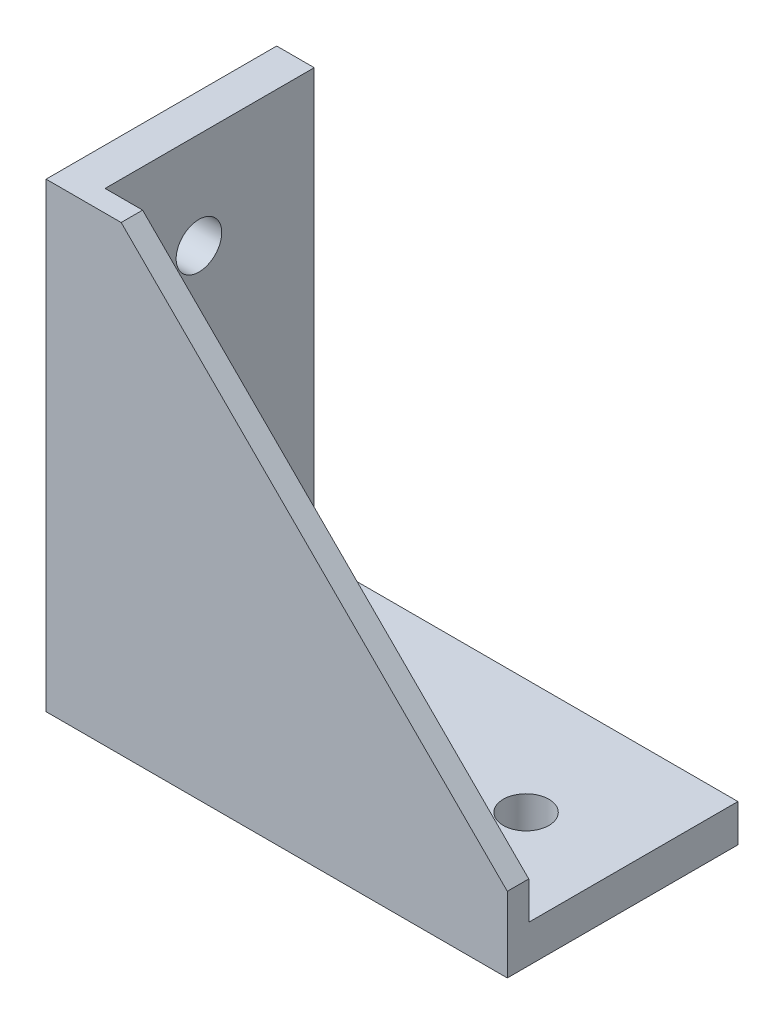
ISO-10303-21;
HEADER;
FILE_DESCRIPTION(('STEP AP214'),'2;1');
FILE_NAME('part.step','',(''),(''),'','','');
FILE_SCHEMA(('AUTOMOTIVE_DESIGN { 1 0 10303 214 1 1 1 1 }'));
ENDSEC;
DATA;
#1=APPLICATION_CONTEXT('core data for automotive mechanical design processes');
#2=APPLICATION_PROTOCOL_DEFINITION('international standard','automotive_design',2000,#1);
#3=PRODUCT_CONTEXT('',#1,'mechanical');
#4=PRODUCT('Part','Part','',(#3));
#5=PRODUCT_RELATED_PRODUCT_CATEGORY('part','',(#4));
#6=PRODUCT_DEFINITION_FORMATION('','',#4);
#7=PRODUCT_DEFINITION_CONTEXT('part definition',#1,'design');
#8=PRODUCT_DEFINITION('design','',#6,#7);
#9=PRODUCT_DEFINITION_SHAPE('','',#8);
#10=(LENGTH_UNIT() NAMED_UNIT(*) SI_UNIT(.MILLI.,.METRE.));
#11=(NAMED_UNIT(*) PLANE_ANGLE_UNIT() SI_UNIT($,.RADIAN.));
#12=(NAMED_UNIT(*) SI_UNIT($,.STERADIAN.) SOLID_ANGLE_UNIT());
#13=UNCERTAINTY_MEASURE_WITH_UNIT(LENGTH_MEASURE(1.E-05),#10,'distance_accuracy_value','');
#14=(GEOMETRIC_REPRESENTATION_CONTEXT(3) GLOBAL_UNCERTAINTY_ASSIGNED_CONTEXT((#13)) GLOBAL_UNIT_ASSIGNED_CONTEXT((#10,
#11,#12)) REPRESENTATION_CONTEXT('',''));
#15=CARTESIAN_POINT('',(0.,0.,0.));
#16=DIRECTION('',(0.,0.,1.));
#17=DIRECTION('',(1.,0.,0.));
#18=AXIS2_PLACEMENT_3D('',#15,#16,#17);
#19=CARTESIAN_POINT('',(0.,0.,21.5));
#20=DIRECTION('',(0.,1.,0.));
#21=DIRECTION('',(0.,0.,1.));
#22=AXIS2_PLACEMENT_3D('',#19,#20,#21);
#23=PLANE('',#22);
#24=DIRECTION('',(0.,0.,1.));
#25=VECTOR('',#24,1.);
#26=CARTESIAN_POINT('',(6.,0.,-5.));
#27=LINE('',#26,#25);
#28=CARTESIAN_POINT('',(6.,0.,-5.));
#29=VERTEX_POINT('',#28);
#30=CARTESIAN_POINT('',(6.,0.,5.));
#31=VERTEX_POINT('',#30);
#32=EDGE_CURVE('E383',#29,#31,#27,.T.);
#33=ORIENTED_EDGE('',*,*,#32,.F.);
#34=DIRECTION('',(1.,0.,0.));
#35=VECTOR('',#34,1.);
#36=CARTESIAN_POINT('',(3.,0.,-5.));
#37=LINE('',#36,#35);
#38=CARTESIAN_POINT('',(3.,0.,-5.));
#39=VERTEX_POINT('',#38);
#40=EDGE_CURVE('E388',#39,#29,#37,.T.);
#41=ORIENTED_EDGE('',*,*,#40,.F.);
#42=DIRECTION('',(0.,0.,-1.));
#43=VECTOR('',#42,1.);
#44=CARTESIAN_POINT('',(3.,0.,-5.));
#45=LINE('',#44,#43);
#46=CARTESIAN_POINT('',(3.,0.,5.));
#47=VERTEX_POINT('',#46);
#48=EDGE_CURVE('E400',#47,#39,#45,.T.);
#49=ORIENTED_EDGE('',*,*,#48,.F.);
#50=DIRECTION('',(-1.,0.,0.));
#51=VECTOR('',#50,1.);
#52=CARTESIAN_POINT('',(3.,0.,5.));
#53=LINE('',#52,#51);
#54=EDGE_CURVE('E397',#31,#47,#53,.T.);
#55=ORIENTED_EDGE('',*,*,#54,.F.);
#56=EDGE_LOOP('',(#33,#41,#49,#55));
#57=FACE_BOUND('',#56,.T.);
#58=DIRECTION('',(-1.,0.,0.));
#59=VECTOR('',#58,1.);
#60=CARTESIAN_POINT('',(20.,0.,-4.25));
#61=LINE('',#60,#59);
#62=CARTESIAN_POINT('',(46.,0.,-4.25));
#63=VERTEX_POINT('',#62);
#64=CARTESIAN_POINT('',(20.,0.,-4.25));
#65=VERTEX_POINT('',#64);
#66=EDGE_CURVE('E427',#63,#65,#61,.T.);
#67=ORIENTED_EDGE('',*,*,#66,.T.);
#68=CARTESIAN_POINT('',(20.,0.,0.));
#69=DIRECTION('',(0.,1.,0.));
#70=DIRECTION('',(0.,0.,1.));
#71=AXIS2_PLACEMENT_3D('',#68,#69,#70);
#72=CIRCLE('',#71,4.25);
#73=CARTESIAN_POINT('',(20.,0.,4.25));
#74=VERTEX_POINT('',#73);
#75=EDGE_CURVE('E417',#65,#74,#72,.T.);
#76=ORIENTED_EDGE('',*,*,#75,.T.);
#77=DIRECTION('',(1.,0.,0.));
#78=VECTOR('',#77,1.);
#79=CARTESIAN_POINT('',(20.,0.,4.25));
#80=LINE('',#79,#78);
#81=CARTESIAN_POINT('',(46.,0.,4.25));
#82=VERTEX_POINT('',#81);
#83=EDGE_CURVE('E420',#74,#82,#80,.T.);
#84=ORIENTED_EDGE('',*,*,#83,.T.);
#85=CARTESIAN_POINT('',(46.,0.,0.));
#86=DIRECTION('',(0.,1.,0.));
#87=DIRECTION('',(0.,0.,1.));
#88=AXIS2_PLACEMENT_3D('',#85,#86,#87);
#89=CIRCLE('',#88,4.25);
#90=EDGE_CURVE('E424',#82,#63,#89,.T.);
#91=ORIENTED_EDGE('',*,*,#90,.T.);
#92=EDGE_LOOP('',(#67,#76,#84,#91));
#93=FACE_BOUND('',#92,.T.);
#94=CARTESIAN_POINT('',(68.,0.,0.));
#95=DIRECTION('',(0.,1.,0.));
#96=DIRECTION('',(0.,0.,1.));
#97=AXIS2_PLACEMENT_3D('',#94,#95,#96);
#98=CIRCLE('',#97,4.25000000000001);
#99=CARTESIAN_POINT('',(68.,0.,4.25000000000001));
#100=VERTEX_POINT('',#99);
#101=EDGE_CURVE('E434',#100,#100,#98,.T.);
#102=ORIENTED_EDGE('',*,*,#101,.T.);
#103=EDGE_LOOP('',(#102));
#104=FACE_BOUND('',#103,.T.);
#105=DIRECTION('',(1.,0.,0.));
#106=VECTOR('',#105,1.);
#107=CARTESIAN_POINT('',(0.,0.,-21.5));
#108=LINE('',#107,#106);
#109=CARTESIAN_POINT('',(0.,0.,-21.5));
#110=VERTEX_POINT('',#109);
#111=CARTESIAN_POINT('',(86.,0.,-21.5));
#112=VERTEX_POINT('',#111);
#113=EDGE_CURVE('E494',#110,#112,#108,.T.);
#114=ORIENTED_EDGE('',*,*,#113,.T.);
#115=DIRECTION('',(0.,0.,-1.));
#116=VECTOR('',#115,1.);
#117=CARTESIAN_POINT('',(86.,0.,21.5));
#118=LINE('',#117,#116);
#119=CARTESIAN_POINT('',(86.,0.,21.5));
#120=VERTEX_POINT('',#119);
#121=EDGE_CURVE('E509',#120,#112,#118,.T.);
#122=ORIENTED_EDGE('',*,*,#121,.F.);
#123=DIRECTION('',(1.,0.,0.));
#124=VECTOR('',#123,1.);
#125=CARTESIAN_POINT('',(0.,0.,21.5));
#126=LINE('',#125,#124);
#127=CARTESIAN_POINT('',(0.,0.,21.5));
#128=VERTEX_POINT('',#127);
#129=EDGE_CURVE('E485',#128,#120,#126,.T.);
#130=ORIENTED_EDGE('',*,*,#129,.F.);
#131=DIRECTION('',(0.,0.,-1.));
#132=VECTOR('',#131,1.);
#133=CARTESIAN_POINT('',(0.,0.,21.5));
#134=LINE('',#133,#132);
#135=EDGE_CURVE('E42',#128,#110,#134,.T.);
#136=ORIENTED_EDGE('',*,*,#135,.T.);
#137=EDGE_LOOP('',(#114,#122,#130,#136));
#138=FACE_BOUND('',#137,.T.);
#139=DIRECTION('',(0.,0.,1.));
#140=VECTOR('',#139,1.);
#141=CARTESIAN_POINT('',(83.,0.,-4.99999999999999));
#142=LINE('',#141,#140);
#143=CARTESIAN_POINT('',(83.,0.,-4.99999999999999));
#144=VERTEX_POINT('',#143);
#145=CARTESIAN_POINT('',(83.,0.,5.00000000000001));
#146=VERTEX_POINT('',#145);
#147=EDGE_CURVE('E340',#144,#146,#142,.T.);
#148=ORIENTED_EDGE('',*,*,#147,.F.);
#149=DIRECTION('',(1.,0.,0.));
#150=VECTOR('',#149,1.);
#151=CARTESIAN_POINT('',(80.,0.,-4.99999999999999));
#152=LINE('',#151,#150);
#153=CARTESIAN_POINT('',(80.,0.,-4.99999999999999));
#154=VERTEX_POINT('',#153);
#155=EDGE_CURVE('E355',#154,#144,#152,.T.);
#156=ORIENTED_EDGE('',*,*,#155,.F.);
#157=DIRECTION('',(0.,0.,-1.));
#158=VECTOR('',#157,1.);
#159=CARTESIAN_POINT('',(80.,0.,-4.99999999999999));
#160=LINE('',#159,#158);
#161=CARTESIAN_POINT('',(80.,0.,5.00000000000001));
#162=VERTEX_POINT('',#161);
#163=EDGE_CURVE('E367',#162,#154,#160,.T.);
#164=ORIENTED_EDGE('',*,*,#163,.F.);
#165=DIRECTION('',(-1.,0.,0.));
#166=VECTOR('',#165,1.);
#167=CARTESIAN_POINT('',(80.,0.,5.00000000000001));
#168=LINE('',#167,#166);
#169=EDGE_CURVE('E364',#146,#162,#168,.T.);
#170=ORIENTED_EDGE('',*,*,#169,.F.);
#171=EDGE_LOOP('',(#148,#156,#164,#170));
#172=FACE_BOUND('',#171,.T.);
#173=ADVANCED_FACE('F34',(#57,#93,#104,#138,#172),#23,.F.);
#174=CARTESIAN_POINT('',(7.,86.,21.5));
#175=DIRECTION('',(0.,-1.,0.));
#176=DIRECTION('',(0.,0.,-1.));
#177=AXIS2_PLACEMENT_3D('',#174,#175,#176);
#178=PLANE('',#177);
#179=DIRECTION('',(-1.,0.,0.));
#180=VECTOR('',#179,1.);
#181=CARTESIAN_POINT('',(7.,86.,-21.5));
#182=LINE('',#181,#180);
#183=CARTESIAN_POINT('',(7.,86.,-21.5));
#184=VERTEX_POINT('',#183);
#185=CARTESIAN_POINT('',(0.,86.,-21.5));
#186=VERTEX_POINT('',#185);
#187=EDGE_CURVE('E476',#184,#186,#182,.T.);
#188=ORIENTED_EDGE('',*,*,#187,.T.);
#189=DIRECTION('',(0.,0.,-1.));
#190=VECTOR('',#189,1.);
#191=CARTESIAN_POINT('',(0.,86.,21.5));
#192=LINE('',#191,#190);
#193=CARTESIAN_POINT('',(0.,86.,21.5));
#194=VERTEX_POINT('',#193);
#195=EDGE_CURVE('E11',#194,#186,#192,.T.);
#196=ORIENTED_EDGE('',*,*,#195,.F.);
#197=DIRECTION('',(-1.,0.,0.));
#198=VECTOR('',#197,1.);
#199=CARTESIAN_POINT('',(7.,86.,21.5));
#200=LINE('',#199,#198);
#201=CARTESIAN_POINT('',(14.,86.,21.5));
#202=VERTEX_POINT('',#201);
#203=EDGE_CURVE('E479',#202,#194,#200,.T.);
#204=ORIENTED_EDGE('',*,*,#203,.F.);
#205=DIRECTION('',(0.,0.,1.));
#206=VECTOR('',#205,1.);
#207=CARTESIAN_POINT('',(14.,86.,17.5));
#208=LINE('',#207,#206);
#209=CARTESIAN_POINT('',(14.,86.,17.5));
#210=VERTEX_POINT('',#209);
#211=EDGE_CURVE('E473',#210,#202,#208,.T.);
#212=ORIENTED_EDGE('',*,*,#211,.F.);
#213=DIRECTION('',(-1.,0.,0.));
#214=VECTOR('',#213,1.);
#215=CARTESIAN_POINT('',(7.,86.,17.5));
#216=LINE('',#215,#214);
#217=CARTESIAN_POINT('',(7.,86.,17.5));
#218=VERTEX_POINT('',#217);
#219=EDGE_CURVE('E455',#210,#218,#216,.T.);
#220=ORIENTED_EDGE('',*,*,#219,.T.);
#221=DIRECTION('',(0.,0.,-1.));
#222=VECTOR('',#221,1.);
#223=CARTESIAN_POINT('',(7.,86.,21.5));
#224=LINE('',#223,#222);
#225=EDGE_CURVE('E489',#218,#184,#224,.T.);
#226=ORIENTED_EDGE('',*,*,#225,.T.);
#227=EDGE_LOOP('',(#188,#196,#204,#212,#220,#226));
#228=FACE_BOUND('',#227,.T.);
#229=ADVANCED_FACE('F36',(#228),#178,.F.);
#230=CARTESIAN_POINT('',(0.,86.,21.5));
#231=DIRECTION('',(1.,0.,0.));
#232=DIRECTION('',(0.,1.,0.));
#233=AXIS2_PLACEMENT_3D('',#230,#231,#232);
#234=PLANE('',#233);
#235=DIRECTION('',(0.,1.,0.));
#236=VECTOR('',#235,1.);
#237=CARTESIAN_POINT('',(0.,80.,-4.99999999999999));
#238=LINE('',#237,#236);
#239=CARTESIAN_POINT('',(0.,80.,-4.99999999999999));
#240=VERTEX_POINT('',#239);
#241=CARTESIAN_POINT('',(0.,83.,-4.99999999999999));
#242=VERTEX_POINT('',#241);
#243=EDGE_CURVE('E275',#240,#242,#238,.T.);
#244=ORIENTED_EDGE('',*,*,#243,.T.);
#245=DIRECTION('',(0.,0.,1.));
#246=VECTOR('',#245,1.);
#247=CARTESIAN_POINT('',(0.,83.,-4.99999999999999));
#248=LINE('',#247,#246);
#249=CARTESIAN_POINT('',(0.,83.,5.00000000000001));
#250=VERTEX_POINT('',#249);
#251=EDGE_CURVE('E249',#242,#250,#248,.T.);
#252=ORIENTED_EDGE('',*,*,#251,.T.);
#253=DIRECTION('',(0.,-1.,0.));
#254=VECTOR('',#253,1.);
#255=CARTESIAN_POINT('',(0.,80.,5.00000000000001));
#256=LINE('',#255,#254);
#257=CARTESIAN_POINT('',(0.,80.,5.00000000000001));
#258=VERTEX_POINT('',#257);
#259=EDGE_CURVE('E265',#250,#258,#256,.T.);
#260=ORIENTED_EDGE('',*,*,#259,.T.);
#261=DIRECTION('',(0.,0.,-1.));
#262=VECTOR('',#261,1.);
#263=CARTESIAN_POINT('',(0.,80.,-4.99999999999999));
#264=LINE('',#263,#262);
#265=EDGE_CURVE('E49',#258,#240,#264,.T.);
#266=ORIENTED_EDGE('',*,*,#265,.T.);
#267=EDGE_LOOP('',(#244,#252,#260,#266));
#268=FACE_BOUND('',#267,.T.);
#269=DIRECTION('',(0.,1.,0.));
#270=VECTOR('',#269,1.);
#271=CARTESIAN_POINT('',(0.,3.,-5.));
#272=LINE('',#271,#270);
#273=CARTESIAN_POINT('',(0.,3.,-5.));
#274=VERTEX_POINT('',#273);
#275=CARTESIAN_POINT('',(0.,6.,-5.));
#276=VERTEX_POINT('',#275);
#277=EDGE_CURVE('E300',#274,#276,#272,.T.);
#278=ORIENTED_EDGE('',*,*,#277,.T.);
#279=DIRECTION('',(0.,0.,1.));
#280=VECTOR('',#279,1.);
#281=CARTESIAN_POINT('',(0.,6.,-5.));
#282=LINE('',#281,#280);
#283=CARTESIAN_POINT('',(0.,6.,5.));
#284=VERTEX_POINT('',#283);
#285=EDGE_CURVE('E254',#276,#284,#282,.T.);
#286=ORIENTED_EDGE('',*,*,#285,.T.);
#287=DIRECTION('',(0.,-1.,0.));
#288=VECTOR('',#287,1.);
#289=CARTESIAN_POINT('',(0.,3.,5.));
#290=LINE('',#289,#288);
#291=CARTESIAN_POINT('',(0.,3.,5.));
#292=VERTEX_POINT('',#291);
#293=EDGE_CURVE('E288',#284,#292,#290,.T.);
#294=ORIENTED_EDGE('',*,*,#293,.T.);
#295=DIRECTION('',(0.,0.,-1.));
#296=VECTOR('',#295,1.);
#297=CARTESIAN_POINT('',(0.,3.,-5.));
#298=LINE('',#297,#296);
#299=EDGE_CURVE('E57',#292,#274,#298,.T.);
#300=ORIENTED_EDGE('',*,*,#299,.T.);
#301=EDGE_LOOP('',(#278,#286,#294,#300));
#302=FACE_BOUND('',#301,.T.);
#303=CARTESIAN_POINT('',(0.,20.,0.));
#304=DIRECTION('',(-1.,0.,0.));
#305=DIRECTION('',(0.,0.,1.));
#306=AXIS2_PLACEMENT_3D('',#303,#304,#305);
#307=CIRCLE('',#306,4.25);
#308=CARTESIAN_POINT('',(0.,20.,-4.25));
#309=VERTEX_POINT('',#308);
#310=CARTESIAN_POINT('',(0.,20.,4.25));
#311=VERTEX_POINT('',#310);
#312=EDGE_CURVE('E314',#309,#311,#307,.T.);
#313=ORIENTED_EDGE('',*,*,#312,.F.);
#314=DIRECTION('',(0.,-1.,0.));
#315=VECTOR('',#314,1.);
#316=CARTESIAN_POINT('',(0.,20.,-4.25));
#317=LINE('',#316,#315);
#318=CARTESIAN_POINT('',(0.,46.,-4.25));
#319=VERTEX_POINT('',#318);
#320=EDGE_CURVE('E316',#319,#309,#317,.T.);
#321=ORIENTED_EDGE('',*,*,#320,.F.);
#322=CARTESIAN_POINT('',(0.,46.,0.));
#323=DIRECTION('',(-1.,0.,0.));
#324=DIRECTION('',(0.,0.,1.));
#325=AXIS2_PLACEMENT_3D('',#322,#323,#324);
#326=CIRCLE('',#325,4.25);
#327=CARTESIAN_POINT('',(0.,46.,4.25));
#328=VERTEX_POINT('',#327);
#329=EDGE_CURVE('E319',#328,#319,#326,.T.);
#330=ORIENTED_EDGE('',*,*,#329,.F.);
#331=DIRECTION('',(0.,1.,0.));
#332=VECTOR('',#331,1.);
#333=CARTESIAN_POINT('',(0.,20.,4.25));
#334=LINE('',#333,#332);
#335=EDGE_CURVE('E322',#311,#328,#334,.T.);
#336=ORIENTED_EDGE('',*,*,#335,.F.);
#337=EDGE_LOOP('',(#313,#321,#330,#336));
#338=FACE_BOUND('',#337,.T.);
#339=CARTESIAN_POINT('',(0.,68.,0.));
#340=DIRECTION('',(-1.,0.,0.));
#341=DIRECTION('',(0.,0.,1.));
#342=AXIS2_PLACEMENT_3D('',#339,#340,#341);
#343=CIRCLE('',#342,4.25000000000001);
#344=CARTESIAN_POINT('',(0.,68.,4.25000000000001));
#345=VERTEX_POINT('',#344);
#346=EDGE_CURVE('E329',#345,#345,#343,.T.);
#347=ORIENTED_EDGE('',*,*,#346,.F.);
#348=EDGE_LOOP('',(#347));
#349=FACE_BOUND('',#348,.T.);
#350=DIRECTION('',(0.,-1.,0.));
#351=VECTOR('',#350,1.);
#352=CARTESIAN_POINT('',(0.,86.,-21.5));
#353=LINE('',#352,#351);
#354=EDGE_CURVE('E492',#186,#110,#353,.T.);
#355=ORIENTED_EDGE('',*,*,#354,.T.);
#356=ORIENTED_EDGE('',*,*,#135,.F.);
#357=DIRECTION('',(0.,-1.,0.));
#358=VECTOR('',#357,1.);
#359=CARTESIAN_POINT('',(0.,86.,21.5));
#360=LINE('',#359,#358);
#361=EDGE_CURVE('E482',#194,#128,#360,.T.);
#362=ORIENTED_EDGE('',*,*,#361,.F.);
#363=ORIENTED_EDGE('',*,*,#195,.T.);
#364=EDGE_LOOP('',(#355,#356,#362,#363));
#365=FACE_BOUND('',#364,.T.);
#366=ADVANCED_FACE('F533',(#268,#302,#338,#349,#365),#234,.F.);
#367=CARTESIAN_POINT('',(86.,0.,21.5));
#368=DIRECTION('',(-1.,0.,0.));
#369=DIRECTION('',(0.,0.,1.));
#370=AXIS2_PLACEMENT_3D('',#367,#368,#369);
#371=PLANE('',#370);
#372=DIRECTION('',(0.,1.,0.));
#373=VECTOR('',#372,1.);
#374=CARTESIAN_POINT('',(86.,0.,-21.5));
#375=LINE('',#374,#373);
#376=CARTESIAN_POINT('',(86.,7.,-21.5));
#377=VERTEX_POINT('',#376);
#378=EDGE_CURVE('E496',#112,#377,#375,.T.);
#379=ORIENTED_EDGE('',*,*,#378,.T.);
#380=DIRECTION('',(0.,0.,-1.));
#381=VECTOR('',#380,1.);
#382=CARTESIAN_POINT('',(86.,7.,21.5));
#383=LINE('',#382,#381);
#384=CARTESIAN_POINT('',(86.,7.,17.5));
#385=VERTEX_POINT('',#384);
#386=EDGE_CURVE('E507',#385,#377,#383,.T.);
#387=ORIENTED_EDGE('',*,*,#386,.F.);
#388=DIRECTION('',(0.,1.,0.));
#389=VECTOR('',#388,1.);
#390=CARTESIAN_POINT('',(86.,14.,17.5));
#391=LINE('',#390,#389);
#392=CARTESIAN_POINT('',(86.,14.,17.5));
#393=VERTEX_POINT('',#392);
#394=EDGE_CURVE('E464',#385,#393,#391,.T.);
#395=ORIENTED_EDGE('',*,*,#394,.T.);
#396=DIRECTION('',(0.,0.,1.));
#397=VECTOR('',#396,1.);
#398=CARTESIAN_POINT('',(86.,14.,17.5));
#399=LINE('',#398,#397);
#400=CARTESIAN_POINT('',(86.,14.,21.5));
#401=VERTEX_POINT('',#400);
#402=EDGE_CURVE('E470',#393,#401,#399,.T.);
#403=ORIENTED_EDGE('',*,*,#402,.T.);
#404=DIRECTION('',(0.,1.,0.));
#405=VECTOR('',#404,1.);
#406=CARTESIAN_POINT('',(86.,0.,21.5));
#407=LINE('',#406,#405);
#408=EDGE_CURVE('E487',#120,#401,#407,.T.);
#409=ORIENTED_EDGE('',*,*,#408,.F.);
#410=ORIENTED_EDGE('',*,*,#121,.T.);
#411=EDGE_LOOP('',(#379,#387,#395,#403,#409,#410));
#412=FACE_BOUND('',#411,.T.);
#413=ADVANCED_FACE('F527',(#412),#371,.F.);
#414=CARTESIAN_POINT('',(7.00000000000001,7.,21.5));
#415=DIRECTION('',(0.,-1.,0.));
#416=DIRECTION('',(0.,0.,-1.));
#417=AXIS2_PLACEMENT_3D('',#414,#415,#416);
#418=PLANE('',#417);
#419=DIRECTION('',(1.,0.,0.));
#420=VECTOR('',#419,1.);
#421=CARTESIAN_POINT('',(20.,7.,4.25));
#422=LINE('',#421,#420);
#423=CARTESIAN_POINT('',(20.,7.,4.25));
#424=VERTEX_POINT('',#423);
#425=CARTESIAN_POINT('',(46.,7.,4.25));
#426=VERTEX_POINT('',#425);
#427=EDGE_CURVE('E433',#424,#426,#422,.T.);
#428=ORIENTED_EDGE('',*,*,#427,.F.);
#429=CARTESIAN_POINT('',(20.,7.,0.));
#430=DIRECTION('',(0.,1.,0.));
#431=DIRECTION('',(0.,0.,1.));
#432=AXIS2_PLACEMENT_3D('',#429,#430,#431);
#433=CIRCLE('',#432,4.25);
#434=CARTESIAN_POINT('',(20.,7.,-4.25));
#435=VERTEX_POINT('',#434);
#436=EDGE_CURVE('E431',#435,#424,#433,.T.);
#437=ORIENTED_EDGE('',*,*,#436,.F.);
#438=DIRECTION('',(-1.,0.,0.));
#439=VECTOR('',#438,1.);
#440=CARTESIAN_POINT('',(20.,7.,-4.25));
#441=LINE('',#440,#439);
#442=CARTESIAN_POINT('',(46.,7.,-4.25));
#443=VERTEX_POINT('',#442);
#444=EDGE_CURVE('E421',#443,#435,#441,.T.);
#445=ORIENTED_EDGE('',*,*,#444,.F.);
#446=CARTESIAN_POINT('',(46.,7.,0.));
#447=DIRECTION('',(0.,1.,0.));
#448=DIRECTION('',(0.,0.,1.));
#449=AXIS2_PLACEMENT_3D('',#446,#447,#448);
#450=CIRCLE('',#449,4.25);
#451=EDGE_CURVE('E437',#426,#443,#450,.T.);
#452=ORIENTED_EDGE('',*,*,#451,.F.);
#453=EDGE_LOOP('',(#428,#437,#445,#452));
#454=FACE_BOUND('',#453,.T.);
#455=CARTESIAN_POINT('',(68.,7.,0.));
#456=DIRECTION('',(0.,1.,0.));
#457=DIRECTION('',(0.,0.,1.));
#458=AXIS2_PLACEMENT_3D('',#455,#456,#457);
#459=CIRCLE('',#458,4.25000000000001);
#460=CARTESIAN_POINT('',(68.,7.,4.25000000000001));
#461=VERTEX_POINT('',#460);
#462=EDGE_CURVE('E416',#461,#461,#459,.T.);
#463=ORIENTED_EDGE('',*,*,#462,.F.);
#464=EDGE_LOOP('',(#463));
#465=FACE_BOUND('',#464,.T.);
#466=DIRECTION('',(0.,0.,-1.));
#467=VECTOR('',#466,1.);
#468=CARTESIAN_POINT('',(7.00000000000001,7.,21.5));
#469=LINE('',#468,#467);
#470=CARTESIAN_POINT('',(7.00000000000001,7.,17.5));
#471=VERTEX_POINT('',#470);
#472=CARTESIAN_POINT('',(7.00000000000001,7.,-21.5));
#473=VERTEX_POINT('',#472);
#474=EDGE_CURVE('E505',#471,#473,#469,.T.);
#475=ORIENTED_EDGE('',*,*,#474,.F.);
#476=DIRECTION('',(1.,0.,0.));
#477=VECTOR('',#476,1.);
#478=CARTESIAN_POINT('',(86.,7.,17.5));
#479=LINE('',#478,#477);
#480=EDGE_CURVE('E461',#471,#385,#479,.T.);
#481=ORIENTED_EDGE('',*,*,#480,.T.);
#482=ORIENTED_EDGE('',*,*,#386,.T.);
#483=DIRECTION('',(-1.,0.,0.));
#484=VECTOR('',#483,1.);
#485=CARTESIAN_POINT('',(7.00000000000001,7.,-21.5));
#486=LINE('',#485,#484);
#487=EDGE_CURVE('E499',#377,#473,#486,.T.);
#488=ORIENTED_EDGE('',*,*,#487,.T.);
#489=EDGE_LOOP('',(#475,#481,#482,#488));
#490=FACE_BOUND('',#489,.T.);
#491=ADVANCED_FACE('F540',(#454,#465,#490),#418,.F.);
#492=CARTESIAN_POINT('',(7.,86.,21.5));
#493=DIRECTION('',(-1.,0.,0.));
#494=DIRECTION('',(0.,-1.,0.));
#495=AXIS2_PLACEMENT_3D('',#492,#493,#494);
#496=PLANE('',#495);
#497=CARTESIAN_POINT('',(7.,20.,0.));
#498=DIRECTION('',(-1.,0.,0.));
#499=DIRECTION('',(0.,0.,1.));
#500=AXIS2_PLACEMENT_3D('',#497,#498,#499);
#501=CIRCLE('',#500,4.25);
#502=CARTESIAN_POINT('',(7.00000000000001,20.,-4.25));
#503=VERTEX_POINT('',#502);
#504=CARTESIAN_POINT('',(7.,20.,4.25));
#505=VERTEX_POINT('',#504);
#506=EDGE_CURVE('E325',#503,#505,#501,.T.);
#507=ORIENTED_EDGE('',*,*,#506,.T.);
#508=DIRECTION('',(0.,1.,0.));
#509=VECTOR('',#508,1.);
#510=CARTESIAN_POINT('',(7.,20.,4.25));
#511=LINE('',#510,#509);
#512=CARTESIAN_POINT('',(7.00000000000001,46.,4.25));
#513=VERTEX_POINT('',#512);
#514=EDGE_CURVE('E317',#505,#513,#511,.T.);
#515=ORIENTED_EDGE('',*,*,#514,.T.);
#516=CARTESIAN_POINT('',(7.00000000000001,46.,0.));
#517=DIRECTION('',(-1.,0.,0.));
#518=DIRECTION('',(0.,0.,1.));
#519=AXIS2_PLACEMENT_3D('',#516,#517,#518);
#520=CIRCLE('',#519,4.25);
#521=CARTESIAN_POINT('',(7.00000000000001,46.,-4.25));
#522=VERTEX_POINT('',#521);
#523=EDGE_CURVE('E332',#513,#522,#520,.T.);
#524=ORIENTED_EDGE('',*,*,#523,.T.);
#525=DIRECTION('',(0.,-1.,0.));
#526=VECTOR('',#525,1.);
#527=CARTESIAN_POINT('',(7.,20.,-4.25));
#528=LINE('',#527,#526);
#529=EDGE_CURVE('E328',#522,#503,#528,.T.);
#530=ORIENTED_EDGE('',*,*,#529,.T.);
#531=EDGE_LOOP('',(#507,#515,#524,#530));
#532=FACE_BOUND('',#531,.T.);
#533=CARTESIAN_POINT('',(7.00000000000002,68.,0.));
#534=DIRECTION('',(-1.,0.,0.));
#535=DIRECTION('',(0.,0.,1.));
#536=AXIS2_PLACEMENT_3D('',#533,#534,#535);
#537=CIRCLE('',#536,4.25000000000001);
#538=CARTESIAN_POINT('',(7.00000000000002,68.,4.25000000000001));
#539=VERTEX_POINT('',#538);
#540=EDGE_CURVE('E313',#539,#539,#537,.T.);
#541=ORIENTED_EDGE('',*,*,#540,.T.);
#542=EDGE_LOOP('',(#541));
#543=FACE_BOUND('',#542,.T.);
#544=ORIENTED_EDGE('',*,*,#225,.F.);
#545=DIRECTION('',(0.,-1.,0.));
#546=VECTOR('',#545,1.);
#547=CARTESIAN_POINT('',(7.00000000000001,7.,17.5));
#548=LINE('',#547,#546);
#549=EDGE_CURVE('E458',#218,#471,#548,.T.);
#550=ORIENTED_EDGE('',*,*,#549,.T.);
#551=ORIENTED_EDGE('',*,*,#474,.T.);
#552=DIRECTION('',(0.,1.,0.));
#553=VECTOR('',#552,1.);
#554=CARTESIAN_POINT('',(7.,86.,-21.5));
#555=LINE('',#554,#553);
#556=EDGE_CURVE('E483',#473,#184,#555,.T.);
#557=ORIENTED_EDGE('',*,*,#556,.T.);
#558=EDGE_LOOP('',(#544,#550,#551,#557));
#559=FACE_BOUND('',#558,.T.);
#560=ADVANCED_FACE('F537',(#532,#543,#559),#496,.F.);
#561=CARTESIAN_POINT('',(0.,0.,21.5));
#562=DIRECTION('',(0.,0.,1.));
#563=DIRECTION('',(1.,0.,0.));
#564=AXIS2_PLACEMENT_3D('',#561,#562,#563);
#565=PLANE('',#564);
#566=ORIENTED_EDGE('',*,*,#203,.T.);
#567=ORIENTED_EDGE('',*,*,#361,.T.);
#568=ORIENTED_EDGE('',*,*,#129,.T.);
#569=ORIENTED_EDGE('',*,*,#408,.T.);
#570=DIRECTION('',(-0.707106781186547,0.707106781186547,0.));
#571=VECTOR('',#570,1.);
#572=CARTESIAN_POINT('',(14.,86.,21.5));
#573=LINE('',#572,#571);
#574=EDGE_CURVE('E444',#401,#202,#573,.T.);
#575=ORIENTED_EDGE('',*,*,#574,.T.);
#576=EDGE_LOOP('',(#566,#567,#568,#569,#575));
#577=FACE_BOUND('',#576,.T.);
#578=ADVANCED_FACE('F531',(#577),#565,.T.);
#579=CARTESIAN_POINT('',(0.,0.,-21.5));
#580=DIRECTION('',(0.,0.,1.));
#581=DIRECTION('',(1.,0.,0.));
#582=AXIS2_PLACEMENT_3D('',#579,#580,#581);
#583=PLANE('',#582);
#584=ORIENTED_EDGE('',*,*,#187,.F.);
#585=ORIENTED_EDGE('',*,*,#556,.F.);
#586=ORIENTED_EDGE('',*,*,#487,.F.);
#587=ORIENTED_EDGE('',*,*,#378,.F.);
#588=ORIENTED_EDGE('',*,*,#113,.F.);
#589=ORIENTED_EDGE('',*,*,#354,.F.);
#590=EDGE_LOOP('',(#584,#585,#586,#587,#588,#589));
#591=FACE_BOUND('',#590,.T.);
#592=ADVANCED_FACE('F522',(#591),#583,.F.);
#593=CARTESIAN_POINT('',(14.,86.,17.5));
#594=DIRECTION('',(0.707106781186547,0.707106781186547,0.));
#595=DIRECTION('',(-0.707106781186548,0.707106781186548,0.));
#596=AXIS2_PLACEMENT_3D('',#593,#594,#595);
#597=PLANE('',#596);
#598=ORIENTED_EDGE('',*,*,#574,.F.);
#599=ORIENTED_EDGE('',*,*,#402,.F.);
#600=DIRECTION('',(-0.707106781186547,0.707106781186547,0.));
#601=VECTOR('',#600,1.);
#602=CARTESIAN_POINT('',(14.,86.,17.5));
#603=LINE('',#602,#601);
#604=EDGE_CURVE('E467',#393,#210,#603,.T.);
#605=ORIENTED_EDGE('',*,*,#604,.T.);
#606=ORIENTED_EDGE('',*,*,#211,.T.);
#607=EDGE_LOOP('',(#598,#599,#605,#606));
#608=FACE_BOUND('',#607,.T.);
#609=ADVANCED_FACE('F546',(#608),#597,.T.);
#610=CARTESIAN_POINT('',(0.,0.,17.5));
#611=DIRECTION('',(0.,0.,-1.));
#612=DIRECTION('',(-1.,0.,0.));
#613=AXIS2_PLACEMENT_3D('',#610,#611,#612);
#614=PLANE('',#613);
#615=ORIENTED_EDGE('',*,*,#219,.F.);
#616=ORIENTED_EDGE('',*,*,#604,.F.);
#617=ORIENTED_EDGE('',*,*,#394,.F.);
#618=ORIENTED_EDGE('',*,*,#480,.F.);
#619=ORIENTED_EDGE('',*,*,#549,.F.);
#620=EDGE_LOOP('',(#615,#616,#617,#618,#619));
#621=FACE_BOUND('',#620,.T.);
#622=ADVANCED_FACE('F543',(#621),#614,.T.);
#623=CARTESIAN_POINT('',(68.,0.,0.));
#624=DIRECTION('',(0.,1.,0.));
#625=DIRECTION('',(0.,0.,1.));
#626=AXIS2_PLACEMENT_3D('',#623,#624,#625);
#627=CYLINDRICAL_SURFACE('',#626,4.25000000000001);
#628=ORIENTED_EDGE('',*,*,#101,.F.);
#629=EDGE_LOOP('',(#628));
#630=FACE_BOUND('',#629,.T.);
#631=ORIENTED_EDGE('',*,*,#462,.T.);
#632=EDGE_LOOP('',(#631));
#633=FACE_BOUND('',#632,.T.);
#634=ADVANCED_FACE('F553',(#630,#633),#627,.F.);
#635=CARTESIAN_POINT('',(20.,0.,0.));
#636=DIRECTION('',(0.,1.,0.));
#637=DIRECTION('',(0.,0.,1.));
#638=AXIS2_PLACEMENT_3D('',#635,#636,#637);
#639=CYLINDRICAL_SURFACE('',#638,4.25);
#640=ORIENTED_EDGE('',*,*,#436,.T.);
#641=DIRECTION('',(0.,1.,0.));
#642=VECTOR('',#641,1.);
#643=CARTESIAN_POINT('',(20.,0.,4.25));
#644=LINE('',#643,#642);
#645=EDGE_CURVE('E430',#74,#424,#644,.T.);
#646=ORIENTED_EDGE('',*,*,#645,.F.);
#647=ORIENTED_EDGE('',*,*,#75,.F.);
#648=DIRECTION('',(0.,1.,0.));
#649=VECTOR('',#648,1.);
#650=CARTESIAN_POINT('',(20.,0.,-4.25));
#651=LINE('',#650,#649);
#652=EDGE_CURVE('E442',#65,#435,#651,.T.);
#653=ORIENTED_EDGE('',*,*,#652,.T.);
#654=EDGE_LOOP('',(#640,#646,#647,#653));
#655=FACE_BOUND('',#654,.T.);
#656=ADVANCED_FACE('F667',(#655),#639,.F.);
#657=CARTESIAN_POINT('',(20.,0.,-4.25));
#658=DIRECTION('',(0.,0.,-1.));
#659=DIRECTION('',(-1.,0.,0.));
#660=AXIS2_PLACEMENT_3D('',#657,#658,#659);
#661=PLANE('',#660);
#662=ORIENTED_EDGE('',*,*,#444,.T.);
#663=ORIENTED_EDGE('',*,*,#652,.F.);
#664=ORIENTED_EDGE('',*,*,#66,.F.);
#665=DIRECTION('',(0.,1.,0.));
#666=VECTOR('',#665,1.);
#667=CARTESIAN_POINT('',(46.,0.,-4.25));
#668=LINE('',#667,#666);
#669=EDGE_CURVE('E445',#63,#443,#668,.T.);
#670=ORIENTED_EDGE('',*,*,#669,.T.);
#671=EDGE_LOOP('',(#662,#663,#664,#670));
#672=FACE_BOUND('',#671,.T.);
#673=ADVANCED_FACE('F663',(#672),#661,.F.);
#674=CARTESIAN_POINT('',(46.,0.,0.));
#675=DIRECTION('',(0.,1.,0.));
#676=DIRECTION('',(0.,0.,1.));
#677=AXIS2_PLACEMENT_3D('',#674,#675,#676);
#678=CYLINDRICAL_SURFACE('',#677,4.25);
#679=ORIENTED_EDGE('',*,*,#451,.T.);
#680=ORIENTED_EDGE('',*,*,#669,.F.);
#681=ORIENTED_EDGE('',*,*,#90,.F.);
#682=DIRECTION('',(0.,1.,0.));
#683=VECTOR('',#682,1.);
#684=CARTESIAN_POINT('',(46.,0.,4.25));
#685=LINE('',#684,#683);
#686=EDGE_CURVE('E447',#82,#426,#685,.T.);
#687=ORIENTED_EDGE('',*,*,#686,.T.);
#688=EDGE_LOOP('',(#679,#680,#681,#687));
#689=FACE_BOUND('',#688,.T.);
#690=ADVANCED_FACE('F666',(#689),#678,.F.);
#691=CARTESIAN_POINT('',(20.,0.,4.25));
#692=DIRECTION('',(0.,0.,1.));
#693=DIRECTION('',(1.,0.,0.));
#694=AXIS2_PLACEMENT_3D('',#691,#692,#693);
#695=PLANE('',#694);
#696=ORIENTED_EDGE('',*,*,#427,.T.);
#697=ORIENTED_EDGE('',*,*,#686,.F.);
#698=ORIENTED_EDGE('',*,*,#83,.F.);
#699=ORIENTED_EDGE('',*,*,#645,.T.);
#700=EDGE_LOOP('',(#696,#697,#698,#699));
#701=FACE_BOUND('',#700,.T.);
#702=ADVANCED_FACE('F661',(#701),#695,.F.);
#703=CARTESIAN_POINT('',(6.,-3.,-5.));
#704=DIRECTION('',(-1.,0.,0.));
#705=DIRECTION('',(0.,0.,1.));
#706=AXIS2_PLACEMENT_3D('',#703,#704,#705);
#707=PLANE('',#706);
#708=ORIENTED_EDGE('',*,*,#32,.T.);
#709=DIRECTION('',(0.,1.,0.));
#710=VECTOR('',#709,1.);
#711=CARTESIAN_POINT('',(6.,-3.,5.));
#712=LINE('',#711,#710);
#713=CARTESIAN_POINT('',(6.,-3.,5.));
#714=VERTEX_POINT('',#713);
#715=EDGE_CURVE('E413',#714,#31,#712,.T.);
#716=ORIENTED_EDGE('',*,*,#715,.F.);
#717=DIRECTION('',(0.,0.,1.));
#718=VECTOR('',#717,1.);
#719=CARTESIAN_POINT('',(6.,-3.,-5.));
#720=LINE('',#719,#718);
#721=CARTESIAN_POINT('',(6.,-3.,-5.));
#722=VERTEX_POINT('',#721);
#723=EDGE_CURVE('E384',#722,#714,#720,.T.);
#724=ORIENTED_EDGE('',*,*,#723,.F.);
#725=DIRECTION('',(0.,1.,0.));
#726=VECTOR('',#725,1.);
#727=CARTESIAN_POINT('',(6.,-3.,-5.));
#728=LINE('',#727,#726);
#729=EDGE_CURVE('E394',#722,#29,#728,.T.);
#730=ORIENTED_EDGE('',*,*,#729,.T.);
#731=EDGE_LOOP('',(#708,#716,#724,#730));
#732=FACE_BOUND('',#731,.T.);
#733=ADVANCED_FACE('F657',(#732),#707,.F.);
#734=CARTESIAN_POINT('',(3.,-3.,5.));
#735=DIRECTION('',(0.,0.,-1.));
#736=DIRECTION('',(-1.,0.,0.));
#737=AXIS2_PLACEMENT_3D('',#734,#735,#736);
#738=PLANE('',#737);
#739=ORIENTED_EDGE('',*,*,#54,.T.);
#740=DIRECTION('',(0.,1.,0.));
#741=VECTOR('',#740,1.);
#742=CARTESIAN_POINT('',(3.,-3.,5.));
#743=LINE('',#742,#741);
#744=CARTESIAN_POINT('',(3.,-3.,5.));
#745=VERTEX_POINT('',#744);
#746=EDGE_CURVE('E410',#745,#47,#743,.T.);
#747=ORIENTED_EDGE('',*,*,#746,.F.);
#748=DIRECTION('',(-1.,0.,0.));
#749=VECTOR('',#748,1.);
#750=CARTESIAN_POINT('',(3.,-3.,5.));
#751=LINE('',#750,#749);
#752=EDGE_CURVE('E387',#714,#745,#751,.T.);
#753=ORIENTED_EDGE('',*,*,#752,.F.);
#754=ORIENTED_EDGE('',*,*,#715,.T.);
#755=EDGE_LOOP('',(#739,#747,#753,#754));
#756=FACE_BOUND('',#755,.T.);
#757=ADVANCED_FACE('F653',(#756),#738,.F.);
#758=CARTESIAN_POINT('',(3.,-3.,-5.));
#759=DIRECTION('',(1.,0.,0.));
#760=DIRECTION('',(0.,0.,-1.));
#761=AXIS2_PLACEMENT_3D('',#758,#759,#760);
#762=PLANE('',#761);
#763=ORIENTED_EDGE('',*,*,#48,.T.);
#764=DIRECTION('',(0.,1.,0.));
#765=VECTOR('',#764,1.);
#766=CARTESIAN_POINT('',(3.,-3.,-5.));
#767=LINE('',#766,#765);
#768=CARTESIAN_POINT('',(3.,-3.,-5.));
#769=VERTEX_POINT('',#768);
#770=EDGE_CURVE('E407',#769,#39,#767,.T.);
#771=ORIENTED_EDGE('',*,*,#770,.F.);
#772=DIRECTION('',(0.,0.,-1.));
#773=VECTOR('',#772,1.);
#774=CARTESIAN_POINT('',(3.,-3.,-5.));
#775=LINE('',#774,#773);
#776=EDGE_CURVE('E390',#745,#769,#775,.T.);
#777=ORIENTED_EDGE('',*,*,#776,.F.);
#778=ORIENTED_EDGE('',*,*,#746,.T.);
#779=EDGE_LOOP('',(#763,#771,#777,#778));
#780=FACE_BOUND('',#779,.T.);
#781=ADVANCED_FACE('F649',(#780),#762,.F.);
#782=CARTESIAN_POINT('',(3.,-3.,-5.));
#783=DIRECTION('',(0.,0.,1.));
#784=DIRECTION('',(1.,0.,0.));
#785=AXIS2_PLACEMENT_3D('',#782,#783,#784);
#786=PLANE('',#785);
#787=ORIENTED_EDGE('',*,*,#40,.T.);
#788=ORIENTED_EDGE('',*,*,#729,.F.);
#789=DIRECTION('',(1.,0.,0.));
#790=VECTOR('',#789,1.);
#791=CARTESIAN_POINT('',(3.,-3.,-5.));
#792=LINE('',#791,#790);
#793=EDGE_CURVE('E392',#769,#722,#792,.T.);
#794=ORIENTED_EDGE('',*,*,#793,.F.);
#795=ORIENTED_EDGE('',*,*,#770,.T.);
#796=EDGE_LOOP('',(#787,#788,#794,#795));
#797=FACE_BOUND('',#796,.T.);
#798=ADVANCED_FACE('F645',(#797),#786,.F.);
#799=CARTESIAN_POINT('',(0.,-3.,0.));
#800=DIRECTION('',(0.,1.,0.));
#801=DIRECTION('',(0.,0.,1.));
#802=AXIS2_PLACEMENT_3D('',#799,#800,#801);
#803=PLANE('',#802);
#804=ORIENTED_EDGE('',*,*,#723,.T.);
#805=ORIENTED_EDGE('',*,*,#752,.T.);
#806=ORIENTED_EDGE('',*,*,#776,.T.);
#807=ORIENTED_EDGE('',*,*,#793,.T.);
#808=EDGE_LOOP('',(#804,#805,#806,#807));
#809=FACE_BOUND('',#808,.T.);
#810=ADVANCED_FACE('F641',(#809),#803,.F.);
#811=CARTESIAN_POINT('',(83.,-3.,-4.99999999999999));
#812=DIRECTION('',(-1.,0.,0.));
#813=DIRECTION('',(0.,0.,1.));
#814=AXIS2_PLACEMENT_3D('',#811,#812,#813);
#815=PLANE('',#814);
#816=ORIENTED_EDGE('',*,*,#147,.T.);
#817=DIRECTION('',(0.,1.,0.));
#818=VECTOR('',#817,1.);
#819=CARTESIAN_POINT('',(83.,-3.,5.00000000000001));
#820=LINE('',#819,#818);
#821=CARTESIAN_POINT('',(83.,-3.,5.00000000000001));
#822=VERTEX_POINT('',#821);
#823=EDGE_CURVE('E380',#822,#146,#820,.T.);
#824=ORIENTED_EDGE('',*,*,#823,.F.);
#825=DIRECTION('',(0.,0.,1.));
#826=VECTOR('',#825,1.);
#827=CARTESIAN_POINT('',(83.,-3.,-4.99999999999999));
#828=LINE('',#827,#826);
#829=CARTESIAN_POINT('',(83.,-3.,-4.99999999999999));
#830=VERTEX_POINT('',#829);
#831=EDGE_CURVE('E351',#830,#822,#828,.T.);
#832=ORIENTED_EDGE('',*,*,#831,.F.);
#833=DIRECTION('',(0.,1.,0.));
#834=VECTOR('',#833,1.);
#835=CARTESIAN_POINT('',(83.,-3.,-4.99999999999999));
#836=LINE('',#835,#834);
#837=EDGE_CURVE('E361',#830,#144,#836,.T.);
#838=ORIENTED_EDGE('',*,*,#837,.T.);
#839=EDGE_LOOP('',(#816,#824,#832,#838));
#840=FACE_BOUND('',#839,.T.);
#841=ADVANCED_FACE('F637',(#840),#815,.F.);
#842=CARTESIAN_POINT('',(80.,-3.,5.00000000000001));
#843=DIRECTION('',(0.,0.,-1.));
#844=DIRECTION('',(-1.,0.,0.));
#845=AXIS2_PLACEMENT_3D('',#842,#843,#844);
#846=PLANE('',#845);
#847=ORIENTED_EDGE('',*,*,#169,.T.);
#848=DIRECTION('',(0.,1.,0.));
#849=VECTOR('',#848,1.);
#850=CARTESIAN_POINT('',(80.,-3.,5.00000000000001));
#851=LINE('',#850,#849);
#852=CARTESIAN_POINT('',(80.,-3.,5.00000000000001));
#853=VERTEX_POINT('',#852);
#854=EDGE_CURVE('E377',#853,#162,#851,.T.);
#855=ORIENTED_EDGE('',*,*,#854,.F.);
#856=DIRECTION('',(-1.,0.,0.));
#857=VECTOR('',#856,1.);
#858=CARTESIAN_POINT('',(80.,-3.,5.00000000000001));
#859=LINE('',#858,#857);
#860=EDGE_CURVE('E354',#822,#853,#859,.T.);
#861=ORIENTED_EDGE('',*,*,#860,.F.);
#862=ORIENTED_EDGE('',*,*,#823,.T.);
#863=EDGE_LOOP('',(#847,#855,#861,#862));
#864=FACE_BOUND('',#863,.T.);
#865=ADVANCED_FACE('F633',(#864),#846,.F.);
#866=CARTESIAN_POINT('',(80.,-3.,-4.99999999999999));
#867=DIRECTION('',(1.,0.,0.));
#868=DIRECTION('',(0.,0.,-1.));
#869=AXIS2_PLACEMENT_3D('',#866,#867,#868);
#870=PLANE('',#869);
#871=ORIENTED_EDGE('',*,*,#163,.T.);
#872=DIRECTION('',(0.,1.,0.));
#873=VECTOR('',#872,1.);
#874=CARTESIAN_POINT('',(80.,-3.,-4.99999999999999));
#875=LINE('',#874,#873);
#876=CARTESIAN_POINT('',(80.,-3.,-4.99999999999999));
#877=VERTEX_POINT('',#876);
#878=EDGE_CURVE('E374',#877,#154,#875,.T.);
#879=ORIENTED_EDGE('',*,*,#878,.F.);
#880=DIRECTION('',(0.,0.,-1.));
#881=VECTOR('',#880,1.);
#882=CARTESIAN_POINT('',(80.,-3.,-4.99999999999999));
#883=LINE('',#882,#881);
#884=EDGE_CURVE('E357',#853,#877,#883,.T.);
#885=ORIENTED_EDGE('',*,*,#884,.F.);
#886=ORIENTED_EDGE('',*,*,#854,.T.);
#887=EDGE_LOOP('',(#871,#879,#885,#886));
#888=FACE_BOUND('',#887,.T.);
#889=ADVANCED_FACE('F629',(#888),#870,.F.);
#890=CARTESIAN_POINT('',(80.,-3.,-4.99999999999999));
#891=DIRECTION('',(0.,0.,1.));
#892=DIRECTION('',(1.,0.,0.));
#893=AXIS2_PLACEMENT_3D('',#890,#891,#892);
#894=PLANE('',#893);
#895=ORIENTED_EDGE('',*,*,#155,.T.);
#896=ORIENTED_EDGE('',*,*,#837,.F.);
#897=DIRECTION('',(1.,0.,0.));
#898=VECTOR('',#897,1.);
#899=CARTESIAN_POINT('',(80.,-3.,-4.99999999999999));
#900=LINE('',#899,#898);
#901=EDGE_CURVE('E359',#877,#830,#900,.T.);
#902=ORIENTED_EDGE('',*,*,#901,.F.);
#903=ORIENTED_EDGE('',*,*,#878,.T.);
#904=EDGE_LOOP('',(#895,#896,#902,#903));
#905=FACE_BOUND('',#904,.T.);
#906=ADVANCED_FACE('F625',(#905),#894,.F.);
#907=CARTESIAN_POINT('',(0.,-3.,0.));
#908=DIRECTION('',(0.,1.,0.));
#909=DIRECTION('',(0.,0.,1.));
#910=AXIS2_PLACEMENT_3D('',#907,#908,#909);
#911=PLANE('',#910);
#912=ORIENTED_EDGE('',*,*,#831,.T.);
#913=ORIENTED_EDGE('',*,*,#860,.T.);
#914=ORIENTED_EDGE('',*,*,#884,.T.);
#915=ORIENTED_EDGE('',*,*,#901,.T.);
#916=EDGE_LOOP('',(#912,#913,#914,#915));
#917=FACE_BOUND('',#916,.T.);
#918=ADVANCED_FACE('F584',(#917),#911,.F.);
#919=CARTESIAN_POINT('',(0.,68.,0.));
#920=DIRECTION('',(1.,0.,0.));
#921=DIRECTION('',(0.,1.,0.));
#922=AXIS2_PLACEMENT_3D('',#919,#920,#921);
#923=CYLINDRICAL_SURFACE('',#922,4.25000000000001);
#924=ORIENTED_EDGE('',*,*,#346,.T.);
#925=EDGE_LOOP('',(#924));
#926=FACE_BOUND('',#925,.T.);
#927=ORIENTED_EDGE('',*,*,#540,.F.);
#928=EDGE_LOOP('',(#927));
#929=FACE_BOUND('',#928,.T.);
#930=ADVANCED_FACE('F580',(#926,#929),#923,.F.);
#931=CARTESIAN_POINT('',(0.,20.,0.));
#932=DIRECTION('',(1.,0.,0.));
#933=DIRECTION('',(0.,1.,0.));
#934=AXIS2_PLACEMENT_3D('',#931,#932,#933);
#935=CYLINDRICAL_SURFACE('',#934,4.25);
#936=ORIENTED_EDGE('',*,*,#506,.F.);
#937=DIRECTION('',(1.,0.,0.));
#938=VECTOR('',#937,1.);
#939=CARTESIAN_POINT('',(0.,20.,-4.25));
#940=LINE('',#939,#938);
#941=EDGE_CURVE('E324',#309,#503,#940,.T.);
#942=ORIENTED_EDGE('',*,*,#941,.F.);
#943=ORIENTED_EDGE('',*,*,#312,.T.);
#944=DIRECTION('',(1.,0.,0.));
#945=VECTOR('',#944,1.);
#946=CARTESIAN_POINT('',(0.,20.,4.25));
#947=LINE('',#946,#945);
#948=EDGE_CURVE('E337',#311,#505,#947,.T.);
#949=ORIENTED_EDGE('',*,*,#948,.T.);
#950=EDGE_LOOP('',(#936,#942,#943,#949));
#951=FACE_BOUND('',#950,.T.);
#952=ADVANCED_FACE('F583',(#951),#935,.F.);
#953=CARTESIAN_POINT('',(0.,20.,4.25));
#954=DIRECTION('',(0.,0.,-1.));
#955=DIRECTION('',(-1.,0.,0.));
#956=AXIS2_PLACEMENT_3D('',#953,#954,#955);
#957=PLANE('',#956);
#958=ORIENTED_EDGE('',*,*,#514,.F.);
#959=ORIENTED_EDGE('',*,*,#948,.F.);
#960=ORIENTED_EDGE('',*,*,#335,.T.);
#961=DIRECTION('',(1.,0.,0.));
#962=VECTOR('',#961,1.);
#963=CARTESIAN_POINT('',(0.,46.,4.25));
#964=LINE('',#963,#962);
#965=EDGE_CURVE('E341',#328,#513,#964,.T.);
#966=ORIENTED_EDGE('',*,*,#965,.T.);
#967=EDGE_LOOP('',(#958,#959,#960,#966));
#968=FACE_BOUND('',#967,.T.);
#969=ADVANCED_FACE('F608',(#968),#957,.T.);
#970=CARTESIAN_POINT('',(0.,46.,0.));
#971=DIRECTION('',(1.,0.,0.));
#972=DIRECTION('',(0.,1.,0.));
#973=AXIS2_PLACEMENT_3D('',#970,#971,#972);
#974=CYLINDRICAL_SURFACE('',#973,4.25);
#975=ORIENTED_EDGE('',*,*,#523,.F.);
#976=ORIENTED_EDGE('',*,*,#965,.F.);
#977=ORIENTED_EDGE('',*,*,#329,.T.);
#978=DIRECTION('',(1.,0.,0.));
#979=VECTOR('',#978,1.);
#980=CARTESIAN_POINT('',(0.,46.,-4.25));
#981=LINE('',#980,#979);
#982=EDGE_CURVE('E343',#319,#522,#981,.T.);
#983=ORIENTED_EDGE('',*,*,#982,.T.);
#984=EDGE_LOOP('',(#975,#976,#977,#983));
#985=FACE_BOUND('',#984,.T.);
#986=ADVANCED_FACE('F606',(#985),#974,.F.);
#987=CARTESIAN_POINT('',(0.,20.,-4.25));
#988=DIRECTION('',(0.,0.,1.));
#989=DIRECTION('',(1.,0.,0.));
#990=AXIS2_PLACEMENT_3D('',#987,#988,#989);
#991=PLANE('',#990);
#992=ORIENTED_EDGE('',*,*,#529,.F.);
#993=ORIENTED_EDGE('',*,*,#982,.F.);
#994=ORIENTED_EDGE('',*,*,#320,.T.);
#995=ORIENTED_EDGE('',*,*,#941,.T.);
#996=EDGE_LOOP('',(#992,#993,#994,#995));
#997=FACE_BOUND('',#996,.T.);
#998=ADVANCED_FACE('F601',(#997),#991,.T.);
#999=CARTESIAN_POINT('',(-3.,6.,-5.));
#1000=DIRECTION('',(0.,1.,0.));
#1001=DIRECTION('',(-1.,0.,0.));
#1002=AXIS2_PLACEMENT_3D('',#999,#1000,#1001);
#1003=PLANE('',#1002);
#1004=ORIENTED_EDGE('',*,*,#285,.F.);
#1005=DIRECTION('',(1.,0.,0.));
#1006=VECTOR('',#1005,1.);
#1007=CARTESIAN_POINT('',(-3.,6.,-5.));
#1008=LINE('',#1007,#1006);
#1009=CARTESIAN_POINT('',(-3.,6.,-5.));
#1010=VERTEX_POINT('',#1009);
#1011=EDGE_CURVE('E311',#1010,#276,#1008,.T.);
#1012=ORIENTED_EDGE('',*,*,#1011,.F.);
#1013=DIRECTION('',(0.,0.,1.));
#1014=VECTOR('',#1013,1.);
#1015=CARTESIAN_POINT('',(-3.,6.,-5.));
#1016=LINE('',#1015,#1014);
#1017=CARTESIAN_POINT('',(-3.,6.,5.));
#1018=VERTEX_POINT('',#1017);
#1019=EDGE_CURVE('E284',#1010,#1018,#1016,.T.);
#1020=ORIENTED_EDGE('',*,*,#1019,.T.);
#1021=DIRECTION('',(1.,0.,0.));
#1022=VECTOR('',#1021,1.);
#1023=CARTESIAN_POINT('',(-3.,6.,5.));
#1024=LINE('',#1023,#1022);
#1025=EDGE_CURVE('E297',#1018,#284,#1024,.T.);
#1026=ORIENTED_EDGE('',*,*,#1025,.T.);
#1027=EDGE_LOOP('',(#1004,#1012,#1020,#1026));
#1028=FACE_BOUND('',#1027,.T.);
#1029=ADVANCED_FACE('F618',(#1028),#1003,.T.);
#1030=CARTESIAN_POINT('',(-3.,3.,-5.));
#1031=DIRECTION('',(0.,0.,-1.));
#1032=DIRECTION('',(0.,1.,0.));
#1033=AXIS2_PLACEMENT_3D('',#1030,#1031,#1032);
#1034=PLANE('',#1033);
#1035=ORIENTED_EDGE('',*,*,#277,.F.);
#1036=DIRECTION('',(1.,0.,0.));
#1037=VECTOR('',#1036,1.);
#1038=CARTESIAN_POINT('',(-3.,3.,-5.));
#1039=LINE('',#1038,#1037);
#1040=CARTESIAN_POINT('',(-3.,3.,-5.));
#1041=VERTEX_POINT('',#1040);
#1042=EDGE_CURVE('E309',#1041,#274,#1039,.T.);
#1043=ORIENTED_EDGE('',*,*,#1042,.F.);
#1044=DIRECTION('',(0.,1.,0.));
#1045=VECTOR('',#1044,1.);
#1046=CARTESIAN_POINT('',(-3.,3.,-5.));
#1047=LINE('',#1046,#1045);
#1048=EDGE_CURVE('E287',#1041,#1010,#1047,.T.);
#1049=ORIENTED_EDGE('',*,*,#1048,.T.);
#1050=ORIENTED_EDGE('',*,*,#1011,.T.);
#1051=EDGE_LOOP('',(#1035,#1043,#1049,#1050));
#1052=FACE_BOUND('',#1051,.T.);
#1053=ADVANCED_FACE('F779',(#1052),#1034,.T.);
#1054=CARTESIAN_POINT('',(-3.,3.,-5.));
#1055=DIRECTION('',(0.,-1.,0.));
#1056=DIRECTION('',(1.,0.,0.));
#1057=AXIS2_PLACEMENT_3D('',#1054,#1055,#1056);
#1058=PLANE('',#1057);
#1059=ORIENTED_EDGE('',*,*,#299,.F.);
#1060=DIRECTION('',(1.,0.,0.));
#1061=VECTOR('',#1060,1.);
#1062=CARTESIAN_POINT('',(-3.,3.,5.));
#1063=LINE('',#1062,#1061);
#1064=CARTESIAN_POINT('',(-3.,3.,5.));
#1065=VERTEX_POINT('',#1064);
#1066=EDGE_CURVE('E307',#1065,#292,#1063,.T.);
#1067=ORIENTED_EDGE('',*,*,#1066,.F.);
#1068=DIRECTION('',(0.,0.,-1.));
#1069=VECTOR('',#1068,1.);
#1070=CARTESIAN_POINT('',(-3.,3.,-5.));
#1071=LINE('',#1070,#1069);
#1072=EDGE_CURVE('E291',#1065,#1041,#1071,.T.);
#1073=ORIENTED_EDGE('',*,*,#1072,.T.);
#1074=ORIENTED_EDGE('',*,*,#1042,.T.);
#1075=EDGE_LOOP('',(#1059,#1067,#1073,#1074));
#1076=FACE_BOUND('',#1075,.T.);
#1077=ADVANCED_FACE('F788',(#1076),#1058,.T.);
#1078=CARTESIAN_POINT('',(-3.,3.,5.));
#1079=DIRECTION('',(0.,0.,1.));
#1080=DIRECTION('',(0.,-1.,0.));
#1081=AXIS2_PLACEMENT_3D('',#1078,#1079,#1080);
#1082=PLANE('',#1081);
#1083=ORIENTED_EDGE('',*,*,#293,.F.);
#1084=ORIENTED_EDGE('',*,*,#1025,.F.);
#1085=DIRECTION('',(0.,-1.,0.));
#1086=VECTOR('',#1085,1.);
#1087=CARTESIAN_POINT('',(-3.,3.,5.));
#1088=LINE('',#1087,#1086);
#1089=EDGE_CURVE('E294',#1018,#1065,#1088,.T.);
#1090=ORIENTED_EDGE('',*,*,#1089,.T.);
#1091=ORIENTED_EDGE('',*,*,#1066,.T.);
#1092=EDGE_LOOP('',(#1083,#1084,#1090,#1091));
#1093=FACE_BOUND('',#1092,.T.);
#1094=ADVANCED_FACE('F797',(#1093),#1082,.T.);
#1095=CARTESIAN_POINT('',(-3.,0.,0.));
#1096=DIRECTION('',(1.,0.,0.));
#1097=DIRECTION('',(0.,0.,1.));
#1098=AXIS2_PLACEMENT_3D('',#1095,#1096,#1097);
#1099=PLANE('',#1098);
#1100=ORIENTED_EDGE('',*,*,#1019,.F.);
#1101=ORIENTED_EDGE('',*,*,#1048,.F.);
#1102=ORIENTED_EDGE('',*,*,#1072,.F.);
#1103=ORIENTED_EDGE('',*,*,#1089,.F.);
#1104=EDGE_LOOP('',(#1100,#1101,#1102,#1103));
#1105=FACE_BOUND('',#1104,.T.);
#1106=ADVANCED_FACE('F806',(#1105),#1099,.F.);
#1107=CARTESIAN_POINT('',(-2.99999999999998,83.,-4.99999999999999));
#1108=DIRECTION('',(0.,1.,0.));
#1109=DIRECTION('',(-1.,0.,0.));
#1110=AXIS2_PLACEMENT_3D('',#1107,#1108,#1109);
#1111=PLANE('',#1110);
#1112=ORIENTED_EDGE('',*,*,#251,.F.);
#1113=DIRECTION('',(1.,0.,0.));
#1114=VECTOR('',#1113,1.);
#1115=CARTESIAN_POINT('',(-2.99999999999998,83.,-4.99999999999999));
#1116=LINE('',#1115,#1114);
#1117=CARTESIAN_POINT('',(-2.99999999999998,83.,-4.99999999999999));
#1118=VERTEX_POINT('',#1117);
#1119=EDGE_CURVE('E243',#1118,#242,#1116,.T.);
#1120=ORIENTED_EDGE('',*,*,#1119,.F.);
#1121=DIRECTION('',(0.,0.,1.));
#1122=VECTOR('',#1121,1.);
#1123=CARTESIAN_POINT('',(-2.99999999999998,83.,-4.99999999999999));
#1124=LINE('',#1123,#1122);
#1125=CARTESIAN_POINT('',(-2.99999999999998,83.,5.00000000000001));
#1126=VERTEX_POINT('',#1125);
#1127=EDGE_CURVE('E246',#1118,#1126,#1124,.T.);
#1128=ORIENTED_EDGE('',*,*,#1127,.T.);
#1129=DIRECTION('',(1.,0.,0.));
#1130=VECTOR('',#1129,1.);
#1131=CARTESIAN_POINT('',(-2.99999999999998,83.,5.00000000000001));
#1132=LINE('',#1131,#1130);
#1133=EDGE_CURVE('E273',#1126,#250,#1132,.T.);
#1134=ORIENTED_EDGE('',*,*,#1133,.T.);
#1135=EDGE_LOOP('',(#1112,#1120,#1128,#1134));
#1136=FACE_BOUND('',#1135,.T.);
#1137=ADVANCED_FACE('F245',(#1136),#1111,.T.);
#1138=CARTESIAN_POINT('',(-2.99999999999998,80.,-4.99999999999999));
#1139=DIRECTION('',(0.,0.,-1.));
#1140=DIRECTION('',(-1.,0.,0.));
#1141=AXIS2_PLACEMENT_3D('',#1138,#1139,#1140);
#1142=PLANE('',#1141);
#1143=ORIENTED_EDGE('',*,*,#243,.F.);
#1144=DIRECTION('',(1.,0.,0.));
#1145=VECTOR('',#1144,1.);
#1146=CARTESIAN_POINT('',(-2.99999999999998,80.,-4.99999999999999));
#1147=LINE('',#1146,#1145);
#1148=CARTESIAN_POINT('',(-2.99999999999998,80.,-4.99999999999999));
#1149=VERTEX_POINT('',#1148);
#1150=EDGE_CURVE('E255',#1149,#240,#1147,.T.);
#1151=ORIENTED_EDGE('',*,*,#1150,.F.);
#1152=DIRECTION('',(0.,1.,0.));
#1153=VECTOR('',#1152,1.);
#1154=CARTESIAN_POINT('',(-2.99999999999998,80.,-4.99999999999999));
#1155=LINE('',#1154,#1153);
#1156=EDGE_CURVE('E261',#1149,#1118,#1155,.T.);
#1157=ORIENTED_EDGE('',*,*,#1156,.T.);
#1158=ORIENTED_EDGE('',*,*,#1119,.T.);
#1159=EDGE_LOOP('',(#1143,#1151,#1157,#1158));
#1160=FACE_BOUND('',#1159,.T.);
#1161=ADVANCED_FACE('F267',(#1160),#1142,.T.);
#1162=CARTESIAN_POINT('',(-2.99999999999998,80.,-4.99999999999999));
#1163=DIRECTION('',(0.,-1.,0.));
#1164=DIRECTION('',(1.,0.,0.));
#1165=AXIS2_PLACEMENT_3D('',#1162,#1163,#1164);
#1166=PLANE('',#1165);
#1167=ORIENTED_EDGE('',*,*,#265,.F.);
#1168=DIRECTION('',(1.,0.,0.));
#1169=VECTOR('',#1168,1.);
#1170=CARTESIAN_POINT('',(-2.99999999999998,80.,5.00000000000001));
#1171=LINE('',#1170,#1169);
#1172=CARTESIAN_POINT('',(-2.99999999999998,80.,5.00000000000001));
#1173=VERTEX_POINT('',#1172);
#1174=EDGE_CURVE('E281',#1173,#258,#1171,.T.);
#1175=ORIENTED_EDGE('',*,*,#1174,.F.);
#1176=DIRECTION('',(0.,0.,-1.));
#1177=VECTOR('',#1176,1.);
#1178=CARTESIAN_POINT('',(-2.99999999999998,80.,-4.99999999999999));
#1179=LINE('',#1178,#1177);
#1180=EDGE_CURVE('E268',#1173,#1149,#1179,.T.);
#1181=ORIENTED_EDGE('',*,*,#1180,.T.);
#1182=ORIENTED_EDGE('',*,*,#1150,.T.);
#1183=EDGE_LOOP('',(#1167,#1175,#1181,#1182));
#1184=FACE_BOUND('',#1183,.T.);
#1185=ADVANCED_FACE('F833',(#1184),#1166,.T.);
#1186=CARTESIAN_POINT('',(-2.99999999999998,80.,5.00000000000001));
#1187=DIRECTION('',(0.,0.,1.));
#1188=DIRECTION('',(1.,0.,0.));
#1189=AXIS2_PLACEMENT_3D('',#1186,#1187,#1188);
#1190=PLANE('',#1189);
#1191=ORIENTED_EDGE('',*,*,#259,.F.);
#1192=ORIENTED_EDGE('',*,*,#1133,.F.);
#1193=DIRECTION('',(0.,-1.,0.));
#1194=VECTOR('',#1193,1.);
#1195=CARTESIAN_POINT('',(-2.99999999999998,80.,5.00000000000001));
#1196=LINE('',#1195,#1194);
#1197=EDGE_CURVE('E264',#1126,#1173,#1196,.T.);
#1198=ORIENTED_EDGE('',*,*,#1197,.T.);
#1199=ORIENTED_EDGE('',*,*,#1174,.T.);
#1200=EDGE_LOOP('',(#1191,#1192,#1198,#1199));
#1201=FACE_BOUND('',#1200,.T.);
#1202=ADVANCED_FACE('F842',(#1201),#1190,.T.);
#1203=CARTESIAN_POINT('',(-3.,0.,0.));
#1204=DIRECTION('',(1.,0.,0.));
#1205=DIRECTION('',(0.,0.,1.));
#1206=AXIS2_PLACEMENT_3D('',#1203,#1204,#1205);
#1207=PLANE('',#1206);
#1208=ORIENTED_EDGE('',*,*,#1127,.F.);
#1209=ORIENTED_EDGE('',*,*,#1156,.F.);
#1210=ORIENTED_EDGE('',*,*,#1180,.F.);
#1211=ORIENTED_EDGE('',*,*,#1197,.F.);
#1212=EDGE_LOOP('',(#1208,#1209,#1210,#1211));
#1213=FACE_BOUND('',#1212,.T.);
#1214=ADVANCED_FACE('F259',(#1213),#1207,.F.);
#1215=CLOSED_SHELL('',(#173,#229,#366,#413,#491,#560,#578,#592,#609,#622,#634,#656,#673,#690,
#702,#733,#757,#781,#798,#810,#841,#865,#889,#906,#918,#930,#952,#969,#986,#998,#1029,#1053,
#1077,#1094,#1106,#1137,#1161,#1185,#1202,#1214));
#1216=MANIFOLD_SOLID_BREP('B2',#1215);
#1217=ADVANCED_BREP_SHAPE_REPRESENTATION('',(#18,#1216),#14);
#1218=SHAPE_DEFINITION_REPRESENTATION(#9,#1217);
ENDSEC;
END-ISO-10303-21;
